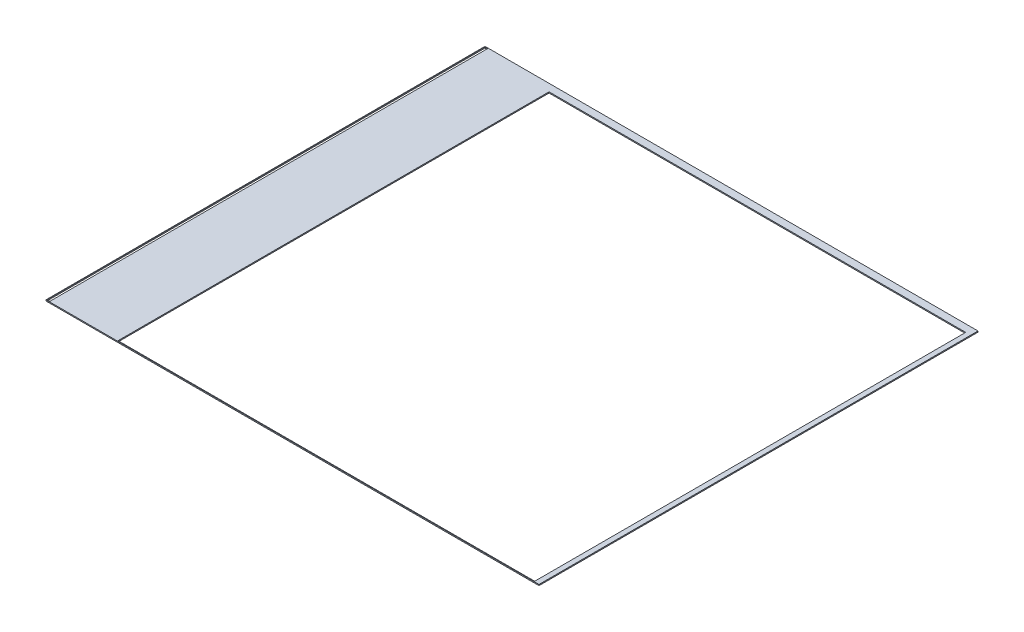
ISO-10303-21;
HEADER;
FILE_DESCRIPTION(('STEP AP214'),'2;1');
FILE_NAME('part.step','',(''),(''),'','','');
FILE_SCHEMA(('AUTOMOTIVE_DESIGN { 1 0 10303 214 1 1 1 1 }'));
ENDSEC;
DATA;
#1=APPLICATION_CONTEXT('core data for automotive mechanical design processes');
#2=APPLICATION_PROTOCOL_DEFINITION('international standard','automotive_design',2000,#1);
#3=PRODUCT_CONTEXT('',#1,'mechanical');
#4=PRODUCT('Part','Part','',(#3));
#5=PRODUCT_RELATED_PRODUCT_CATEGORY('part','',(#4));
#6=PRODUCT_DEFINITION_FORMATION('','',#4);
#7=PRODUCT_DEFINITION_CONTEXT('part definition',#1,'design');
#8=PRODUCT_DEFINITION('design','',#6,#7);
#9=PRODUCT_DEFINITION_SHAPE('','',#8);
#10=(LENGTH_UNIT() NAMED_UNIT(*) SI_UNIT(.MILLI.,.METRE.));
#11=(NAMED_UNIT(*) PLANE_ANGLE_UNIT() SI_UNIT($,.RADIAN.));
#12=(NAMED_UNIT(*) SI_UNIT($,.STERADIAN.) SOLID_ANGLE_UNIT());
#13=UNCERTAINTY_MEASURE_WITH_UNIT(LENGTH_MEASURE(1.E-05),#10,'distance_accuracy_value','');
#14=(GEOMETRIC_REPRESENTATION_CONTEXT(3) GLOBAL_UNCERTAINTY_ASSIGNED_CONTEXT((#13)) GLOBAL_UNIT_ASSIGNED_CONTEXT((#10,
#11,#12)) REPRESENTATION_CONTEXT('',''));
#15=CARTESIAN_POINT('',(0.,0.,0.));
#16=DIRECTION('',(0.,0.,1.));
#17=DIRECTION('',(1.,0.,0.));
#18=AXIS2_PLACEMENT_3D('',#15,#16,#17);
#19=CARTESIAN_POINT('',(-11.365,0.05,-10.12));
#20=DIRECTION('',(1.,0.,0.));
#21=DIRECTION('',(0.,0.,-1.));
#22=AXIS2_PLACEMENT_3D('',#19,#20,#21);
#23=PLANE('',#22);
#24=DIRECTION('',(0.,0.,1.));
#25=VECTOR('',#24,1.);
#26=CARTESIAN_POINT('',(-11.365,0.,-10.12));
#27=LINE('',#26,#25);
#28=CARTESIAN_POINT('',(-11.365,0.,-10.12));
#29=VERTEX_POINT('',#28);
#30=CARTESIAN_POINT('',(-11.365,0.,10.12));
#31=VERTEX_POINT('',#30);
#32=EDGE_CURVE('E184',#29,#31,#27,.T.);
#33=ORIENTED_EDGE('',*,*,#32,.T.);
#34=DIRECTION('',(0.,-1.,0.));
#35=VECTOR('',#34,1.);
#36=CARTESIAN_POINT('',(-11.365,0.05,10.12));
#37=LINE('',#36,#35);
#38=CARTESIAN_POINT('',(-11.365,0.05,10.12));
#39=VERTEX_POINT('',#38);
#40=EDGE_CURVE('E11',#39,#31,#37,.T.);
#41=ORIENTED_EDGE('',*,*,#40,.F.);
#42=DIRECTION('',(0.,0.,1.));
#43=VECTOR('',#42,1.);
#44=CARTESIAN_POINT('',(-11.365,0.05,-10.12));
#45=LINE('',#44,#43);
#46=CARTESIAN_POINT('',(-11.365,0.05,-10.12));
#47=VERTEX_POINT('',#46);
#48=EDGE_CURVE('E191',#47,#39,#45,.T.);
#49=ORIENTED_EDGE('',*,*,#48,.F.);
#50=DIRECTION('',(0.,-1.,0.));
#51=VECTOR('',#50,1.);
#52=CARTESIAN_POINT('',(-11.365,0.05,-10.12));
#53=LINE('',#52,#51);
#54=EDGE_CURVE('E201',#47,#29,#53,.T.);
#55=ORIENTED_EDGE('',*,*,#54,.T.);
#56=EDGE_LOOP('',(#33,#41,#49,#55));
#57=FACE_BOUND('',#56,.T.);
#58=ADVANCED_FACE('F34',(#57),#23,.F.);
#59=CARTESIAN_POINT('',(-11.365,0.05,10.12));
#60=DIRECTION('',(0.,0.,-1.));
#61=DIRECTION('',(-1.,0.,0.));
#62=AXIS2_PLACEMENT_3D('',#59,#60,#61);
#63=PLANE('',#62);
#64=DIRECTION('',(1.,0.,0.));
#65=VECTOR('',#64,1.);
#66=CARTESIAN_POINT('',(-11.365,0.,10.12));
#67=LINE('',#66,#65);
#68=CARTESIAN_POINT('',(11.365,0.,10.12));
#69=VERTEX_POINT('',#68);
#70=EDGE_CURVE('E204',#31,#69,#67,.T.);
#71=ORIENTED_EDGE('',*,*,#70,.T.);
#72=DIRECTION('',(0.,-1.,0.));
#73=VECTOR('',#72,1.);
#74=CARTESIAN_POINT('',(11.365,0.05,10.12));
#75=LINE('',#74,#73);
#76=CARTESIAN_POINT('',(11.365,0.05,10.12));
#77=VERTEX_POINT('',#76);
#78=EDGE_CURVE('E41',#77,#69,#75,.T.);
#79=ORIENTED_EDGE('',*,*,#78,.F.);
#80=DIRECTION('',(1.,0.,0.));
#81=VECTOR('',#80,1.);
#82=CARTESIAN_POINT('',(-11.365,0.05,10.12));
#83=LINE('',#82,#81);
#84=EDGE_CURVE('E194',#39,#77,#83,.T.);
#85=ORIENTED_EDGE('',*,*,#84,.F.);
#86=ORIENTED_EDGE('',*,*,#40,.T.);
#87=EDGE_LOOP('',(#71,#79,#85,#86));
#88=FACE_BOUND('',#87,.T.);
#89=ADVANCED_FACE('F233',(#88),#63,.F.);
#90=CARTESIAN_POINT('',(11.365,0.05,-10.12));
#91=DIRECTION('',(-1.,0.,0.));
#92=DIRECTION('',(0.,0.,1.));
#93=AXIS2_PLACEMENT_3D('',#90,#91,#92);
#94=PLANE('',#93);
#95=DIRECTION('',(0.,0.,-1.));
#96=VECTOR('',#95,1.);
#97=CARTESIAN_POINT('',(11.365,0.,-10.12));
#98=LINE('',#97,#96);
#99=CARTESIAN_POINT('',(11.365,0.,-10.12));
#100=VERTEX_POINT('',#99);
#101=EDGE_CURVE('E206',#69,#100,#98,.T.);
#102=ORIENTED_EDGE('',*,*,#101,.T.);
#103=DIRECTION('',(0.,-1.,0.));
#104=VECTOR('',#103,1.);
#105=CARTESIAN_POINT('',(11.365,0.05,-10.12));
#106=LINE('',#105,#104);
#107=CARTESIAN_POINT('',(11.365,0.05,-10.12));
#108=VERTEX_POINT('',#107);
#109=EDGE_CURVE('E211',#108,#100,#106,.T.);
#110=ORIENTED_EDGE('',*,*,#109,.F.);
#111=DIRECTION('',(0.,0.,-1.));
#112=VECTOR('',#111,1.);
#113=CARTESIAN_POINT('',(11.365,0.05,-10.12));
#114=LINE('',#113,#112);
#115=EDGE_CURVE('E197',#77,#108,#114,.T.);
#116=ORIENTED_EDGE('',*,*,#115,.F.);
#117=ORIENTED_EDGE('',*,*,#78,.T.);
#118=EDGE_LOOP('',(#102,#110,#116,#117));
#119=FACE_BOUND('',#118,.T.);
#120=ADVANCED_FACE('F218',(#119),#94,.F.);
#121=CARTESIAN_POINT('',(-11.365,0.05,-10.12));
#122=DIRECTION('',(0.,0.,1.));
#123=DIRECTION('',(1.,0.,0.));
#124=AXIS2_PLACEMENT_3D('',#121,#122,#123);
#125=PLANE('',#124);
#126=DIRECTION('',(-1.,0.,0.));
#127=VECTOR('',#126,1.);
#128=CARTESIAN_POINT('',(-11.365,0.,-10.12));
#129=LINE('',#128,#127);
#130=EDGE_CURVE('E195',#100,#29,#129,.T.);
#131=ORIENTED_EDGE('',*,*,#130,.T.);
#132=ORIENTED_EDGE('',*,*,#54,.F.);
#133=DIRECTION('',(-1.,0.,0.));
#134=VECTOR('',#133,1.);
#135=CARTESIAN_POINT('',(-11.365,0.05,-10.12));
#136=LINE('',#135,#134);
#137=EDGE_CURVE('E199',#108,#47,#136,.T.);
#138=ORIENTED_EDGE('',*,*,#137,.F.);
#139=ORIENTED_EDGE('',*,*,#109,.T.);
#140=EDGE_LOOP('',(#131,#132,#138,#139));
#141=FACE_BOUND('',#140,.T.);
#142=ADVANCED_FACE('F227',(#141),#125,.F.);
#143=CARTESIAN_POINT('',(-11.365,0.05,10.12));
#144=DIRECTION('',(0.,1.,0.));
#145=DIRECTION('',(0.,0.,1.));
#146=AXIS2_PLACEMENT_3D('',#143,#144,#145);
#147=PLANE('',#146);
#148=DIRECTION('',(0.,0.,-1.));
#149=VECTOR('',#148,1.);
#150=CARTESIAN_POINT('',(-8.0718,0.05,-9.780625));
#151=LINE('',#150,#149);
#152=CARTESIAN_POINT('',(-8.0718,0.05,10.091375));
#153=VERTEX_POINT('',#152);
#154=CARTESIAN_POINT('',(-8.0718,0.05,-9.780625));
#155=VERTEX_POINT('',#154);
#156=EDGE_CURVE('E124',#153,#155,#151,.T.);
#157=ORIENTED_EDGE('',*,*,#156,.T.);
#158=DIRECTION('',(1.,0.,0.));
#159=VECTOR('',#158,1.);
#160=CARTESIAN_POINT('',(11.1378,0.05,-9.780625));
#161=LINE('',#160,#159);
#162=CARTESIAN_POINT('',(11.1378,0.05,-9.780625));
#163=VERTEX_POINT('',#162);
#164=EDGE_CURVE('E133',#155,#163,#161,.T.);
#165=ORIENTED_EDGE('',*,*,#164,.T.);
#166=DIRECTION('',(0.,0.,1.));
#167=VECTOR('',#166,1.);
#168=CARTESIAN_POINT('',(11.1378,0.05,10.091375));
#169=LINE('',#168,#167);
#170=CARTESIAN_POINT('',(11.1378,0.05,10.091375));
#171=VERTEX_POINT('',#170);
#172=EDGE_CURVE('E48',#163,#171,#169,.T.);
#173=ORIENTED_EDGE('',*,*,#172,.T.);
#174=DIRECTION('',(-1.,0.,0.));
#175=VECTOR('',#174,1.);
#176=CARTESIAN_POINT('',(-8.0718,0.05,10.091375));
#177=LINE('',#176,#175);
#178=EDGE_CURVE('E130',#171,#153,#177,.T.);
#179=ORIENTED_EDGE('',*,*,#178,.T.);
#180=EDGE_LOOP('',(#157,#165,#173,#179));
#181=FACE_BOUND('',#180,.T.);
#182=DIRECTION('',(0.,0.,-1.));
#183=VECTOR('',#182,1.);
#184=CARTESIAN_POINT('',(-11.3446,0.05,-10.09685));
#185=LINE('',#184,#183);
#186=CARTESIAN_POINT('',(-11.3446,0.05,10.08815));
#187=VERTEX_POINT('',#186);
#188=CARTESIAN_POINT('',(-11.3446,0.05,-10.09685));
#189=VERTEX_POINT('',#188);
#190=EDGE_CURVE('E159',#187,#189,#185,.T.);
#191=ORIENTED_EDGE('',*,*,#190,.T.);
#192=DIRECTION('',(1.,0.,0.));
#193=VECTOR('',#192,1.);
#194=CARTESIAN_POINT('',(-11.2146,0.05,-10.09685));
#195=LINE('',#194,#193);
#196=CARTESIAN_POINT('',(-11.2146,0.05,-10.09685));
#197=VERTEX_POINT('',#196);
#198=EDGE_CURVE('E162',#189,#197,#195,.T.);
#199=ORIENTED_EDGE('',*,*,#198,.T.);
#200=DIRECTION('',(0.,0.,1.));
#201=VECTOR('',#200,1.);
#202=CARTESIAN_POINT('',(-11.2146,0.05,10.08815));
#203=LINE('',#202,#201);
#204=CARTESIAN_POINT('',(-11.2146,0.05,10.08815));
#205=VERTEX_POINT('',#204);
#206=EDGE_CURVE('E166',#197,#205,#203,.T.);
#207=ORIENTED_EDGE('',*,*,#206,.T.);
#208=DIRECTION('',(-1.,0.,0.));
#209=VECTOR('',#208,1.);
#210=CARTESIAN_POINT('',(-11.3446,0.05,10.08815));
#211=LINE('',#210,#209);
#212=EDGE_CURVE('E169',#205,#187,#211,.T.);
#213=ORIENTED_EDGE('',*,*,#212,.T.);
#214=EDGE_LOOP('',(#191,#199,#207,#213));
#215=FACE_BOUND('',#214,.T.);
#216=ORIENTED_EDGE('',*,*,#48,.T.);
#217=ORIENTED_EDGE('',*,*,#84,.T.);
#218=ORIENTED_EDGE('',*,*,#115,.T.);
#219=ORIENTED_EDGE('',*,*,#137,.T.);
#220=EDGE_LOOP('',(#216,#217,#218,#219));
#221=FACE_BOUND('',#220,.T.);
#222=ADVANCED_FACE('F137',(#181,#215,#221),#147,.T.);
#223=CARTESIAN_POINT('',(-11.365,0.,10.12));
#224=DIRECTION('',(0.,1.,0.));
#225=DIRECTION('',(0.,0.,1.));
#226=AXIS2_PLACEMENT_3D('',#223,#224,#225);
#227=PLANE('',#226);
#228=DIRECTION('',(1.,0.,0.));
#229=VECTOR('',#228,1.);
#230=CARTESIAN_POINT('',(11.1378,0.,-9.780625));
#231=LINE('',#230,#229);
#232=CARTESIAN_POINT('',(-8.0718,0.,-9.780625));
#233=VERTEX_POINT('',#232);
#234=CARTESIAN_POINT('',(11.1378,0.,-9.780625));
#235=VERTEX_POINT('',#234);
#236=EDGE_CURVE('E149',#233,#235,#231,.T.);
#237=ORIENTED_EDGE('',*,*,#236,.F.);
#238=DIRECTION('',(0.,0.,-1.));
#239=VECTOR('',#238,1.);
#240=CARTESIAN_POINT('',(-8.0718,0.,-9.780625));
#241=LINE('',#240,#239);
#242=CARTESIAN_POINT('',(-8.0718,0.,10.091375));
#243=VERTEX_POINT('',#242);
#244=EDGE_CURVE('E56',#243,#233,#241,.T.);
#245=ORIENTED_EDGE('',*,*,#244,.F.);
#246=DIRECTION('',(-1.,0.,0.));
#247=VECTOR('',#246,1.);
#248=CARTESIAN_POINT('',(-8.0718,0.,10.091375));
#249=LINE('',#248,#247);
#250=CARTESIAN_POINT('',(11.1378,0.,10.091375));
#251=VERTEX_POINT('',#250);
#252=EDGE_CURVE('E140',#251,#243,#249,.T.);
#253=ORIENTED_EDGE('',*,*,#252,.F.);
#254=DIRECTION('',(0.,0.,1.));
#255=VECTOR('',#254,1.);
#256=CARTESIAN_POINT('',(11.1378,0.,10.091375));
#257=LINE('',#256,#255);
#258=EDGE_CURVE('E143',#235,#251,#257,.T.);
#259=ORIENTED_EDGE('',*,*,#258,.F.);
#260=EDGE_LOOP('',(#237,#245,#253,#259));
#261=FACE_BOUND('',#260,.T.);
#262=DIRECTION('',(1.,0.,0.));
#263=VECTOR('',#262,1.);
#264=CARTESIAN_POINT('',(-11.2146,0.,-10.09685));
#265=LINE('',#264,#263);
#266=CARTESIAN_POINT('',(-11.3446,0.,-10.09685));
#267=VERTEX_POINT('',#266);
#268=CARTESIAN_POINT('',(-11.2146,0.,-10.09685));
#269=VERTEX_POINT('',#268);
#270=EDGE_CURVE('E174',#267,#269,#265,.T.);
#271=ORIENTED_EDGE('',*,*,#270,.F.);
#272=DIRECTION('',(0.,0.,-1.));
#273=VECTOR('',#272,1.);
#274=CARTESIAN_POINT('',(-11.3446,0.,-10.09685));
#275=LINE('',#274,#273);
#276=CARTESIAN_POINT('',(-11.3446,0.,10.08815));
#277=VERTEX_POINT('',#276);
#278=EDGE_CURVE('E155',#277,#267,#275,.T.);
#279=ORIENTED_EDGE('',*,*,#278,.F.);
#280=DIRECTION('',(-1.,0.,0.));
#281=VECTOR('',#280,1.);
#282=CARTESIAN_POINT('',(-11.3446,0.,10.08815));
#283=LINE('',#282,#281);
#284=CARTESIAN_POINT('',(-11.2146,0.,10.08815));
#285=VERTEX_POINT('',#284);
#286=EDGE_CURVE('E163',#285,#277,#283,.T.);
#287=ORIENTED_EDGE('',*,*,#286,.F.);
#288=DIRECTION('',(0.,0.,1.));
#289=VECTOR('',#288,1.);
#290=CARTESIAN_POINT('',(-11.2146,0.,10.08815));
#291=LINE('',#290,#289);
#292=EDGE_CURVE('E177',#269,#285,#291,.T.);
#293=ORIENTED_EDGE('',*,*,#292,.F.);
#294=EDGE_LOOP('',(#271,#279,#287,#293));
#295=FACE_BOUND('',#294,.T.);
#296=ORIENTED_EDGE('',*,*,#32,.F.);
#297=ORIENTED_EDGE('',*,*,#130,.F.);
#298=ORIENTED_EDGE('',*,*,#101,.F.);
#299=ORIENTED_EDGE('',*,*,#70,.F.);
#300=EDGE_LOOP('',(#296,#297,#298,#299));
#301=FACE_BOUND('',#300,.T.);
#302=ADVANCED_FACE('F224',(#261,#295,#301),#227,.F.);
#303=CARTESIAN_POINT('',(-11.3446,0.05,-10.09685));
#304=DIRECTION('',(-1.,0.,0.));
#305=DIRECTION('',(0.,0.,1.));
#306=AXIS2_PLACEMENT_3D('',#303,#304,#305);
#307=PLANE('',#306);
#308=ORIENTED_EDGE('',*,*,#278,.T.);
#309=DIRECTION('',(0.,-1.,0.));
#310=VECTOR('',#309,1.);
#311=CARTESIAN_POINT('',(-11.3446,0.05,-10.09685));
#312=LINE('',#311,#310);
#313=EDGE_CURVE('E172',#189,#267,#312,.T.);
#314=ORIENTED_EDGE('',*,*,#313,.F.);
#315=ORIENTED_EDGE('',*,*,#190,.F.);
#316=DIRECTION('',(0.,-1.,0.));
#317=VECTOR('',#316,1.);
#318=CARTESIAN_POINT('',(-11.3446,0.05,10.08815));
#319=LINE('',#318,#317);
#320=EDGE_CURVE('E182',#187,#277,#319,.T.);
#321=ORIENTED_EDGE('',*,*,#320,.T.);
#322=EDGE_LOOP('',(#308,#314,#315,#321));
#323=FACE_BOUND('',#322,.T.);
#324=ADVANCED_FACE('F245',(#323),#307,.F.);
#325=CARTESIAN_POINT('',(-11.3446,0.05,10.08815));
#326=DIRECTION('',(0.,0.,1.));
#327=DIRECTION('',(1.,0.,0.));
#328=AXIS2_PLACEMENT_3D('',#325,#326,#327);
#329=PLANE('',#328);
#330=ORIENTED_EDGE('',*,*,#286,.T.);
#331=ORIENTED_EDGE('',*,*,#320,.F.);
#332=ORIENTED_EDGE('',*,*,#212,.F.);
#333=DIRECTION('',(0.,-1.,0.));
#334=VECTOR('',#333,1.);
#335=CARTESIAN_POINT('',(-11.2146,0.05,10.08815));
#336=LINE('',#335,#334);
#337=EDGE_CURVE('E185',#205,#285,#336,.T.);
#338=ORIENTED_EDGE('',*,*,#337,.T.);
#339=EDGE_LOOP('',(#330,#331,#332,#338));
#340=FACE_BOUND('',#339,.T.);
#341=ADVANCED_FACE('F251',(#340),#329,.F.);
#342=CARTESIAN_POINT('',(-11.2146,0.05,10.08815));
#343=DIRECTION('',(1.,0.,0.));
#344=DIRECTION('',(0.,0.,-1.));
#345=AXIS2_PLACEMENT_3D('',#342,#343,#344);
#346=PLANE('',#345);
#347=ORIENTED_EDGE('',*,*,#292,.T.);
#348=ORIENTED_EDGE('',*,*,#337,.F.);
#349=ORIENTED_EDGE('',*,*,#206,.F.);
#350=DIRECTION('',(0.,-1.,0.));
#351=VECTOR('',#350,1.);
#352=CARTESIAN_POINT('',(-11.2146,0.05,-10.09685));
#353=LINE('',#352,#351);
#354=EDGE_CURVE('E187',#197,#269,#353,.T.);
#355=ORIENTED_EDGE('',*,*,#354,.T.);
#356=EDGE_LOOP('',(#347,#348,#349,#355));
#357=FACE_BOUND('',#356,.T.);
#358=ADVANCED_FACE('F256',(#357),#346,.F.);
#359=CARTESIAN_POINT('',(-11.2146,0.05,-10.09685));
#360=DIRECTION('',(0.,0.,-1.));
#361=DIRECTION('',(-1.,0.,0.));
#362=AXIS2_PLACEMENT_3D('',#359,#360,#361);
#363=PLANE('',#362);
#364=ORIENTED_EDGE('',*,*,#270,.T.);
#365=ORIENTED_EDGE('',*,*,#354,.F.);
#366=ORIENTED_EDGE('',*,*,#198,.F.);
#367=ORIENTED_EDGE('',*,*,#313,.T.);
#368=EDGE_LOOP('',(#364,#365,#366,#367));
#369=FACE_BOUND('',#368,.T.);
#370=ADVANCED_FACE('F253',(#369),#363,.F.);
#371=CARTESIAN_POINT('',(-8.0718,0.05,-9.780625));
#372=DIRECTION('',(-1.,0.,0.));
#373=DIRECTION('',(0.,0.,1.));
#374=AXIS2_PLACEMENT_3D('',#371,#372,#373);
#375=PLANE('',#374);
#376=ORIENTED_EDGE('',*,*,#244,.T.);
#377=DIRECTION('',(0.,-1.,0.));
#378=VECTOR('',#377,1.);
#379=CARTESIAN_POINT('',(-8.0718,0.05,-9.780625));
#380=LINE('',#379,#378);
#381=EDGE_CURVE('E120',#155,#233,#380,.T.);
#382=ORIENTED_EDGE('',*,*,#381,.F.);
#383=ORIENTED_EDGE('',*,*,#156,.F.);
#384=DIRECTION('',(0.,-1.,0.));
#385=VECTOR('',#384,1.);
#386=CARTESIAN_POINT('',(-8.0718,0.05,10.091375));
#387=LINE('',#386,#385);
#388=EDGE_CURVE('E153',#153,#243,#387,.T.);
#389=ORIENTED_EDGE('',*,*,#388,.T.);
#390=EDGE_LOOP('',(#376,#382,#383,#389));
#391=FACE_BOUND('',#390,.T.);
#392=ADVANCED_FACE('F122',(#391),#375,.F.);
#393=CARTESIAN_POINT('',(-8.0718,0.05,10.091375));
#394=DIRECTION('',(0.,0.,1.));
#395=DIRECTION('',(1.,0.,0.));
#396=AXIS2_PLACEMENT_3D('',#393,#394,#395);
#397=PLANE('',#396);
#398=ORIENTED_EDGE('',*,*,#252,.T.);
#399=ORIENTED_EDGE('',*,*,#388,.F.);
#400=ORIENTED_EDGE('',*,*,#178,.F.);
#401=DIRECTION('',(0.,-1.,0.));
#402=VECTOR('',#401,1.);
#403=CARTESIAN_POINT('',(11.1378,0.05,10.091375));
#404=LINE('',#403,#402);
#405=EDGE_CURVE('E156',#171,#251,#404,.T.);
#406=ORIENTED_EDGE('',*,*,#405,.T.);
#407=EDGE_LOOP('',(#398,#399,#400,#406));
#408=FACE_BOUND('',#407,.T.);
#409=ADVANCED_FACE('F266',(#408),#397,.F.);
#410=CARTESIAN_POINT('',(11.1378,0.05,10.091375));
#411=DIRECTION('',(1.,0.,0.));
#412=DIRECTION('',(0.,0.,-1.));
#413=AXIS2_PLACEMENT_3D('',#410,#411,#412);
#414=PLANE('',#413);
#415=ORIENTED_EDGE('',*,*,#258,.T.);
#416=ORIENTED_EDGE('',*,*,#405,.F.);
#417=ORIENTED_EDGE('',*,*,#172,.F.);
#418=DIRECTION('',(0.,-1.,0.));
#419=VECTOR('',#418,1.);
#420=CARTESIAN_POINT('',(11.1378,0.05,-9.780625));
#421=LINE('',#420,#419);
#422=EDGE_CURVE('E129',#163,#235,#421,.T.);
#423=ORIENTED_EDGE('',*,*,#422,.T.);
#424=EDGE_LOOP('',(#415,#416,#417,#423));
#425=FACE_BOUND('',#424,.T.);
#426=ADVANCED_FACE('F269',(#425),#414,.F.);
#427=CARTESIAN_POINT('',(11.1378,0.05,-9.780625));
#428=DIRECTION('',(0.,0.,-1.));
#429=DIRECTION('',(-1.,0.,0.));
#430=AXIS2_PLACEMENT_3D('',#427,#428,#429);
#431=PLANE('',#430);
#432=ORIENTED_EDGE('',*,*,#236,.T.);
#433=ORIENTED_EDGE('',*,*,#422,.F.);
#434=ORIENTED_EDGE('',*,*,#164,.F.);
#435=ORIENTED_EDGE('',*,*,#381,.T.);
#436=EDGE_LOOP('',(#432,#433,#434,#435));
#437=FACE_BOUND('',#436,.T.);
#438=ADVANCED_FACE('F134',(#437),#431,.F.);
#439=CLOSED_SHELL('',(#58,#89,#120,#142,#222,#302,#324,#341,#358,#370,#392,#409,#426,#438));
#440=MANIFOLD_SOLID_BREP('B2',#439);
#441=ADVANCED_BREP_SHAPE_REPRESENTATION('',(#18,#440),#14);
#442=SHAPE_DEFINITION_REPRESENTATION(#9,#441);
ENDSEC;
END-ISO-10303-21;
